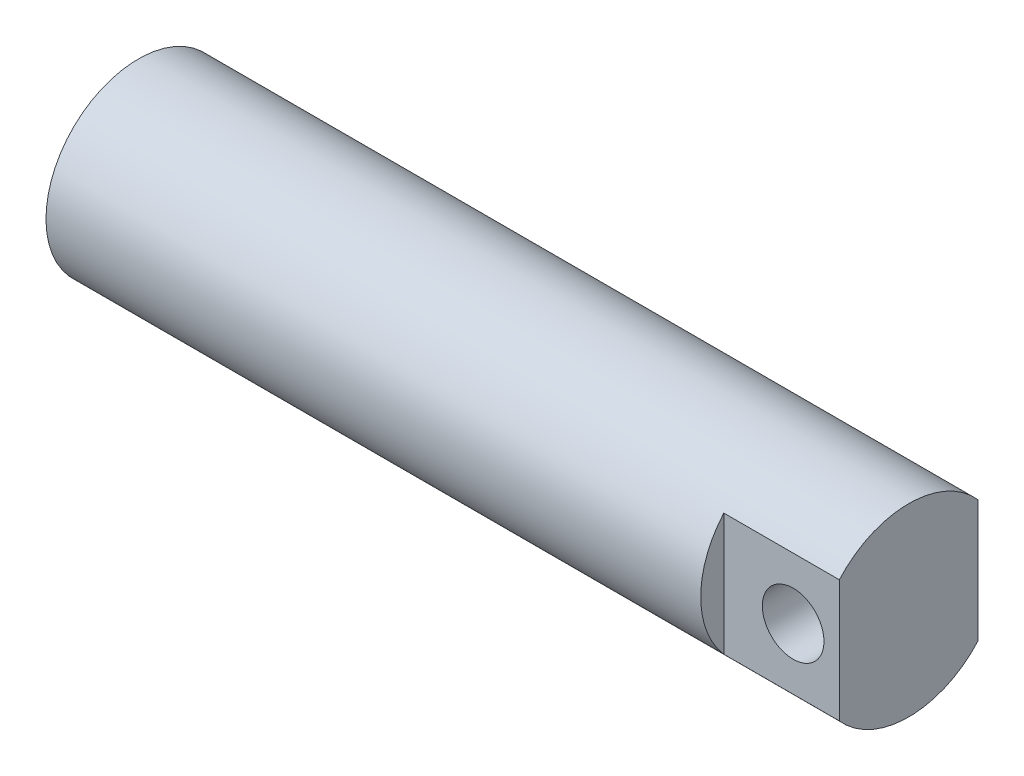
ISO-10303-21;
HEADER;
FILE_DESCRIPTION(('STEP AP214'),'2;1');
FILE_NAME('part.step','',(''),(''),'','','');
FILE_SCHEMA(('AUTOMOTIVE_DESIGN { 1 0 10303 214 1 1 1 1 }'));
ENDSEC;
DATA;
#1=APPLICATION_CONTEXT('core data for automotive mechanical design processes');
#2=APPLICATION_PROTOCOL_DEFINITION('international standard','automotive_design',2000,#1);
#3=PRODUCT_CONTEXT('',#1,'mechanical');
#4=PRODUCT('Part','Part','',(#3));
#5=PRODUCT_RELATED_PRODUCT_CATEGORY('part','',(#4));
#6=PRODUCT_DEFINITION_FORMATION('','',#4);
#7=PRODUCT_DEFINITION_CONTEXT('part definition',#1,'design');
#8=PRODUCT_DEFINITION('design','',#6,#7);
#9=PRODUCT_DEFINITION_SHAPE('','',#8);
#10=(LENGTH_UNIT() NAMED_UNIT(*) SI_UNIT(.MILLI.,.METRE.));
#11=(NAMED_UNIT(*) PLANE_ANGLE_UNIT() SI_UNIT($,.RADIAN.));
#12=(NAMED_UNIT(*) SI_UNIT($,.STERADIAN.) SOLID_ANGLE_UNIT());
#13=UNCERTAINTY_MEASURE_WITH_UNIT(LENGTH_MEASURE(1.E-05),#10,'distance_accuracy_value','');
#14=(GEOMETRIC_REPRESENTATION_CONTEXT(3) GLOBAL_UNCERTAINTY_ASSIGNED_CONTEXT((#13)) GLOBAL_UNIT_ASSIGNED_CONTEXT((#10,
#11,#12)) REPRESENTATION_CONTEXT('',''));
#15=CARTESIAN_POINT('',(0.,0.,0.));
#16=DIRECTION('',(0.,0.,1.));
#17=DIRECTION('',(1.,0.,0.));
#18=AXIS2_PLACEMENT_3D('',#15,#16,#17);
#19=CARTESIAN_POINT('',(158.75,0.,0.));
#20=DIRECTION('',(-1.,0.,0.));
#21=DIRECTION('',(0.,0.,1.));
#22=AXIS2_PLACEMENT_3D('',#19,#20,#21);
#23=CYLINDRICAL_SURFACE('',#22,38.1);
#24=CARTESIAN_POINT('',(158.75,0.,0.));
#25=DIRECTION('',(1.,0.,0.));
#26=DIRECTION('',(0.,0.,-1.));
#27=AXIS2_PLACEMENT_3D('',#24,#25,#26);
#28=CIRCLE('',#27,38.1);
#29=CARTESIAN_POINT('',(158.75,25.2007812378902,-28.575));
#30=VERTEX_POINT('',#29);
#31=CARTESIAN_POINT('',(158.75,25.2007812378902,28.575));
#32=VERTEX_POINT('',#31);
#33=EDGE_CURVE('E43',#30,#32,#28,.T.);
#34=ORIENTED_EDGE('',*,*,#33,.F.);
#35=DIRECTION('',(1.,0.,0.));
#36=VECTOR('',#35,1.);
#37=CARTESIAN_POINT('',(111.125,25.2007812378902,-28.575));
#38=LINE('',#37,#36);
#39=CARTESIAN_POINT('',(111.125,25.2007812378902,-28.575));
#40=VERTEX_POINT('',#39);
#41=EDGE_CURVE('E51',#40,#30,#38,.T.);
#42=ORIENTED_EDGE('',*,*,#41,.F.);
#43=CARTESIAN_POINT('',(111.125,0.,0.));
#44=DIRECTION('',(1.,0.,0.));
#45=DIRECTION('',(0.,0.,-1.));
#46=AXIS2_PLACEMENT_3D('',#43,#44,#45);
#47=CIRCLE('',#46,38.1);
#48=CARTESIAN_POINT('',(111.125,-25.2007812378902,-28.575));
#49=VERTEX_POINT('',#48);
#50=EDGE_CURVE('E80',#49,#40,#47,.T.);
#51=ORIENTED_EDGE('',*,*,#50,.F.);
#52=DIRECTION('',(1.,0.,0.));
#53=VECTOR('',#52,1.);
#54=CARTESIAN_POINT('',(111.125,-25.2007812378902,-28.575));
#55=LINE('',#54,#53);
#56=CARTESIAN_POINT('',(158.75,-25.2007812378902,-28.575));
#57=VERTEX_POINT('',#56);
#58=EDGE_CURVE('E88',#49,#57,#55,.T.);
#59=ORIENTED_EDGE('',*,*,#58,.T.);
#60=CARTESIAN_POINT('',(158.75,-25.2007812378902,28.575));
#61=VERTEX_POINT('',#60);
#62=EDGE_CURVE('E11',#61,#57,#28,.T.);
#63=ORIENTED_EDGE('',*,*,#62,.F.);
#64=DIRECTION('',(1.,0.,0.));
#65=VECTOR('',#64,1.);
#66=CARTESIAN_POINT('',(111.125,-25.2007812378902,28.575));
#67=LINE('',#66,#65);
#68=CARTESIAN_POINT('',(111.125,-25.2007812378902,28.575));
#69=VERTEX_POINT('',#68);
#70=EDGE_CURVE('E59',#69,#61,#67,.T.);
#71=ORIENTED_EDGE('',*,*,#70,.F.);
#72=CARTESIAN_POINT('',(111.125,0.,0.));
#73=DIRECTION('',(1.,0.,0.));
#74=DIRECTION('',(0.,0.,-1.));
#75=AXIS2_PLACEMENT_3D('',#72,#73,#74);
#76=CIRCLE('',#75,38.1);
#77=CARTESIAN_POINT('',(111.125,25.2007812378902,28.575));
#78=VERTEX_POINT('',#77);
#79=EDGE_CURVE('E98',#78,#69,#76,.T.);
#80=ORIENTED_EDGE('',*,*,#79,.F.);
#81=DIRECTION('',(1.,0.,0.));
#82=VECTOR('',#81,1.);
#83=CARTESIAN_POINT('',(111.125,25.2007812378902,28.575));
#84=LINE('',#83,#82);
#85=EDGE_CURVE('E104',#78,#32,#84,.T.);
#86=ORIENTED_EDGE('',*,*,#85,.T.);
#87=EDGE_LOOP('',(#34,#42,#51,#59,#63,#71,#80,#86));
#88=FACE_BOUND('',#87,.T.);
#89=CARTESIAN_POINT('',(-158.75,0.,0.));
#90=DIRECTION('',(1.,0.,0.));
#91=DIRECTION('',(0.,0.,-1.));
#92=AXIS2_PLACEMENT_3D('',#89,#90,#91);
#93=CIRCLE('',#92,38.1);
#94=CARTESIAN_POINT('',(-158.75,0.,-38.1));
#95=VERTEX_POINT('',#94);
#96=EDGE_CURVE('E106',#95,#95,#93,.T.);
#97=ORIENTED_EDGE('',*,*,#96,.T.);
#98=EDGE_LOOP('',(#97));
#99=FACE_BOUND('',#98,.T.);
#100=ADVANCED_FACE('F35',(#88,#99),#23,.T.);
#101=CARTESIAN_POINT('',(158.75,0.,0.));
#102=DIRECTION('',(1.,0.,0.));
#103=DIRECTION('',(0.,0.,-1.));
#104=AXIS2_PLACEMENT_3D('',#101,#102,#103);
#105=PLANE('',#104);
#106=DIRECTION('',(0.,-1.,0.));
#107=VECTOR('',#106,1.);
#108=CARTESIAN_POINT('',(158.75,25.2007812378902,-28.575));
#109=LINE('',#108,#107);
#110=EDGE_CURVE('E85',#30,#57,#109,.T.);
#111=ORIENTED_EDGE('',*,*,#110,.F.);
#112=ORIENTED_EDGE('',*,*,#33,.T.);
#113=DIRECTION('',(0.,1.,0.));
#114=VECTOR('',#113,1.);
#115=CARTESIAN_POINT('',(158.75,25.2007812378902,28.575));
#116=LINE('',#115,#114);
#117=EDGE_CURVE('E94',#61,#32,#116,.T.);
#118=ORIENTED_EDGE('',*,*,#117,.F.);
#119=ORIENTED_EDGE('',*,*,#62,.T.);
#120=EDGE_LOOP('',(#111,#112,#118,#119));
#121=FACE_BOUND('',#120,.T.);
#122=ADVANCED_FACE('F110',(#121),#105,.T.);
#123=CARTESIAN_POINT('',(-158.75,0.,0.));
#124=DIRECTION('',(1.,0.,0.));
#125=DIRECTION('',(0.,0.,-1.));
#126=AXIS2_PLACEMENT_3D('',#123,#124,#125);
#127=PLANE('',#126);
#128=ORIENTED_EDGE('',*,*,#96,.F.);
#129=EDGE_LOOP('',(#128));
#130=FACE_BOUND('',#129,.T.);
#131=ADVANCED_FACE('F124',(#130),#127,.F.);
#132=CARTESIAN_POINT('',(111.125,25.2007812378902,28.575));
#133=DIRECTION('',(0.,0.,-1.));
#134=DIRECTION('',(0.,1.,0.));
#135=AXIS2_PLACEMENT_3D('',#132,#133,#134);
#136=PLANE('',#135);
#137=CARTESIAN_POINT('',(139.7,0.,28.575));
#138=DIRECTION('',(0.,0.,1.));
#139=DIRECTION('',(1.,0.,0.));
#140=AXIS2_PLACEMENT_3D('',#137,#138,#139);
#141=CIRCLE('',#140,12.7);
#142=CARTESIAN_POINT('',(152.4,0.,28.575));
#143=VERTEX_POINT('',#142);
#144=EDGE_CURVE('E174',#143,#143,#141,.T.);
#145=ORIENTED_EDGE('',*,*,#144,.F.);
#146=EDGE_LOOP('',(#145));
#147=FACE_BOUND('',#146,.T.);
#148=ORIENTED_EDGE('',*,*,#117,.T.);
#149=ORIENTED_EDGE('',*,*,#85,.F.);
#150=DIRECTION('',(0.,1.,0.));
#151=VECTOR('',#150,1.);
#152=CARTESIAN_POINT('',(111.125,25.2007812378902,28.575));
#153=LINE('',#152,#151);
#154=EDGE_CURVE('E100',#69,#78,#153,.T.);
#155=ORIENTED_EDGE('',*,*,#154,.F.);
#156=ORIENTED_EDGE('',*,*,#70,.T.);
#157=EDGE_LOOP('',(#148,#149,#155,#156));
#158=FACE_BOUND('',#157,.T.);
#159=ADVANCED_FACE('F112',(#147,#158),#136,.F.);
#160=CARTESIAN_POINT('',(111.125,0.,0.));
#161=DIRECTION('',(1.,0.,0.));
#162=DIRECTION('',(0.,0.,-1.));
#163=AXIS2_PLACEMENT_3D('',#160,#161,#162);
#164=PLANE('',#163);
#165=ORIENTED_EDGE('',*,*,#79,.T.);
#166=ORIENTED_EDGE('',*,*,#154,.T.);
#167=EDGE_LOOP('',(#165,#166));
#168=FACE_BOUND('',#167,.T.);
#169=ADVANCED_FACE('F115',(#168),#164,.T.);
#170=CARTESIAN_POINT('',(111.125,25.2007812378902,-28.575));
#171=DIRECTION('',(0.,0.,1.));
#172=DIRECTION('',(1.,0.,0.));
#173=AXIS2_PLACEMENT_3D('',#170,#171,#172);
#174=PLANE('',#173);
#175=CARTESIAN_POINT('',(139.7,0.,-28.575));
#176=DIRECTION('',(0.,0.,1.));
#177=DIRECTION('',(1.,0.,0.));
#178=AXIS2_PLACEMENT_3D('',#175,#176,#177);
#179=CIRCLE('',#178,12.7);
#180=CARTESIAN_POINT('',(152.4,0.,-28.575));
#181=VERTEX_POINT('',#180);
#182=EDGE_CURVE('E38',#181,#181,#179,.T.);
#183=ORIENTED_EDGE('',*,*,#182,.T.);
#184=EDGE_LOOP('',(#183));
#185=FACE_BOUND('',#184,.T.);
#186=ORIENTED_EDGE('',*,*,#110,.T.);
#187=ORIENTED_EDGE('',*,*,#58,.F.);
#188=DIRECTION('',(0.,-1.,0.));
#189=VECTOR('',#188,1.);
#190=CARTESIAN_POINT('',(111.125,25.2007812378902,-28.575));
#191=LINE('',#190,#189);
#192=EDGE_CURVE('E82',#40,#49,#191,.T.);
#193=ORIENTED_EDGE('',*,*,#192,.F.);
#194=ORIENTED_EDGE('',*,*,#41,.T.);
#195=EDGE_LOOP('',(#186,#187,#193,#194));
#196=FACE_BOUND('',#195,.T.);
#197=ADVANCED_FACE('F87',(#185,#196),#174,.F.);
#198=CARTESIAN_POINT('',(111.125,0.,0.));
#199=DIRECTION('',(1.,0.,0.));
#200=DIRECTION('',(0.,0.,-1.));
#201=AXIS2_PLACEMENT_3D('',#198,#199,#200);
#202=PLANE('',#201);
#203=ORIENTED_EDGE('',*,*,#50,.T.);
#204=ORIENTED_EDGE('',*,*,#192,.T.);
#205=EDGE_LOOP('',(#203,#204));
#206=FACE_BOUND('',#205,.T.);
#207=ADVANCED_FACE('F81',(#206),#202,.T.);
#208=CARTESIAN_POINT('',(139.7,0.,-38.1));
#209=DIRECTION('',(0.,0.,1.));
#210=DIRECTION('',(1.,0.,0.));
#211=AXIS2_PLACEMENT_3D('',#208,#209,#210);
#212=CYLINDRICAL_SURFACE('',#211,12.7);
#213=ORIENTED_EDGE('',*,*,#144,.T.);
#214=EDGE_LOOP('',(#213));
#215=FACE_BOUND('',#214,.T.);
#216=ORIENTED_EDGE('',*,*,#182,.F.);
#217=EDGE_LOOP('',(#216));
#218=FACE_BOUND('',#217,.T.);
#219=ADVANCED_FACE('F158',(#215,#218),#212,.F.);
#220=CLOSED_SHELL('',(#100,#122,#131,#159,#169,#197,#207,#219));
#221=MANIFOLD_SOLID_BREP('B2',#220);
#222=ADVANCED_BREP_SHAPE_REPRESENTATION('',(#18,#221),#14);
#223=SHAPE_DEFINITION_REPRESENTATION(#9,#222);
ENDSEC;
END-ISO-10303-21;
